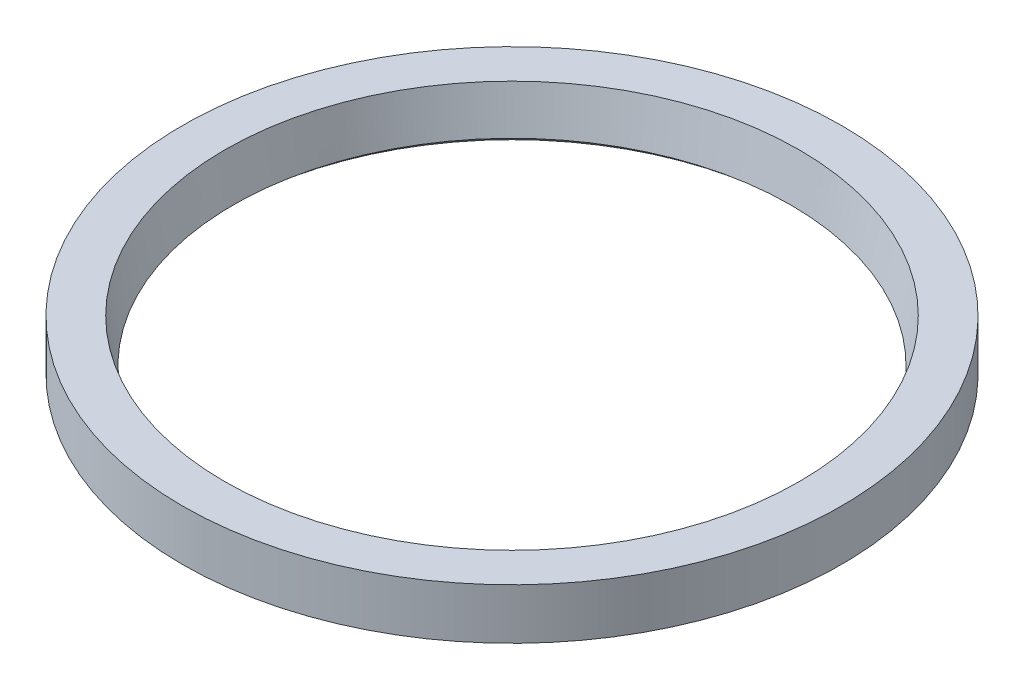
ISO-10303-21;
HEADER;
FILE_DESCRIPTION(('STEP AP214'),'2;1');
FILE_NAME('part.step','',(''),(''),'','','');
FILE_SCHEMA(('AUTOMOTIVE_DESIGN { 1 0 10303 214 1 1 1 1 }'));
ENDSEC;
DATA;
#1=APPLICATION_CONTEXT('core data for automotive mechanical design processes');
#2=APPLICATION_PROTOCOL_DEFINITION('international standard','automotive_design',2000,#1);
#3=PRODUCT_CONTEXT('',#1,'mechanical');
#4=PRODUCT('Part','Part','',(#3));
#5=PRODUCT_RELATED_PRODUCT_CATEGORY('part','',(#4));
#6=PRODUCT_DEFINITION_FORMATION('','',#4);
#7=PRODUCT_DEFINITION_CONTEXT('part definition',#1,'design');
#8=PRODUCT_DEFINITION('design','',#6,#7);
#9=PRODUCT_DEFINITION_SHAPE('','',#8);
#10=(LENGTH_UNIT() NAMED_UNIT(*) SI_UNIT(.MILLI.,.METRE.));
#11=(NAMED_UNIT(*) PLANE_ANGLE_UNIT() SI_UNIT($,.RADIAN.));
#12=(NAMED_UNIT(*) SI_UNIT($,.STERADIAN.) SOLID_ANGLE_UNIT());
#13=UNCERTAINTY_MEASURE_WITH_UNIT(LENGTH_MEASURE(1.E-05),#10,'distance_accuracy_value','');
#14=(GEOMETRIC_REPRESENTATION_CONTEXT(3) GLOBAL_UNCERTAINTY_ASSIGNED_CONTEXT((#13)) GLOBAL_UNIT_ASSIGNED_CONTEXT((#10,
#11,#12)) REPRESENTATION_CONTEXT('',''));
#15=CARTESIAN_POINT('',(0.,0.,0.));
#16=DIRECTION('',(0.,0.,1.));
#17=DIRECTION('',(1.,0.,0.));
#18=AXIS2_PLACEMENT_3D('',#15,#16,#17);
#19=CARTESIAN_POINT('',(0.,0.434794772802015,0.));
#20=DIRECTION('',(0.,-1.,0.));
#21=DIRECTION('',(0.,0.,-1.));
#22=AXIS2_PLACEMENT_3D('',#19,#20,#21);
#23=CONICAL_SURFACE('',#22,16.4887012150477,0.866085653235625);
#24=CARTESIAN_POINT('',(0.,0.,0.));
#25=DIRECTION('',(0.,-1.,0.));
#26=DIRECTION('',(0.,0.,-1.));
#27=AXIS2_PLACEMENT_3D('',#24,#25,#26);
#28=CIRCLE('',#27,17.);
#29=CARTESIAN_POINT('',(0.,0.,-17.));
#30=VERTEX_POINT('',#29);
#31=EDGE_CURVE('E54',#30,#30,#28,.T.);
#32=ORIENTED_EDGE('',*,*,#31,.T.);
#33=EDGE_LOOP('',(#32));
#34=FACE_BOUND('',#33,.T.);
#35=CARTESIAN_POINT('',(0.,0.434794772802015,0.));
#36=DIRECTION('',(0.,-1.,0.));
#37=DIRECTION('',(0.,0.,-1.));
#38=AXIS2_PLACEMENT_3D('',#35,#36,#37);
#39=CIRCLE('',#38,16.4887012150477);
#40=CARTESIAN_POINT('',(0.,0.434794772802015,-16.4887012150477));
#41=VERTEX_POINT('',#40);
#42=EDGE_CURVE('E10',#41,#41,#39,.T.);
#43=ORIENTED_EDGE('',*,*,#42,.F.);
#44=EDGE_LOOP('',(#43));
#45=FACE_BOUND('',#44,.T.);
#46=ADVANCED_FACE('F35',(#34,#45),#23,.F.);
#47=CARTESIAN_POINT('',(0.,3.,0.));
#48=DIRECTION('',(0.,1.,0.));
#49=DIRECTION('',(0.,0.,1.));
#50=AXIS2_PLACEMENT_3D('',#47,#48,#49);
#51=CONICAL_SURFACE('',#50,17.,0.196742407793568);
#52=ORIENTED_EDGE('',*,*,#42,.T.);
#53=EDGE_LOOP('',(#52));
#54=FACE_BOUND('',#53,.T.);
#55=CARTESIAN_POINT('',(0.,3.,0.));
#56=DIRECTION('',(0.,-1.,0.));
#57=DIRECTION('',(0.,0.,-1.));
#58=AXIS2_PLACEMENT_3D('',#55,#56,#57);
#59=CIRCLE('',#58,17.);
#60=CARTESIAN_POINT('',(0.,3.,-17.));
#61=VERTEX_POINT('',#60);
#62=EDGE_CURVE('E41',#61,#61,#59,.T.);
#63=ORIENTED_EDGE('',*,*,#62,.F.);
#64=EDGE_LOOP('',(#63));
#65=FACE_BOUND('',#64,.T.);
#66=ADVANCED_FACE('F72',(#54,#65),#51,.F.);
#67=CARTESIAN_POINT('',(19.5,3.,0.));
#68=DIRECTION('',(0.,1.,0.));
#69=DIRECTION('',(0.,0.,1.));
#70=AXIS2_PLACEMENT_3D('',#67,#68,#69);
#71=PLANE('',#70);
#72=ORIENTED_EDGE('',*,*,#62,.T.);
#73=EDGE_LOOP('',(#72));
#74=FACE_BOUND('',#73,.T.);
#75=CARTESIAN_POINT('',(0.,3.,0.));
#76=DIRECTION('',(0.,-1.,0.));
#77=DIRECTION('',(0.,0.,-1.));
#78=AXIS2_PLACEMENT_3D('',#75,#76,#77);
#79=CIRCLE('',#78,19.5);
#80=CARTESIAN_POINT('',(0.,3.,-19.5));
#81=VERTEX_POINT('',#80);
#82=EDGE_CURVE('E45',#81,#81,#79,.T.);
#83=ORIENTED_EDGE('',*,*,#82,.F.);
#84=EDGE_LOOP('',(#83));
#85=FACE_BOUND('',#84,.T.);
#86=ADVANCED_FACE('F68',(#74,#85),#71,.T.);
#87=CARTESIAN_POINT('',(0.,0.,0.));
#88=DIRECTION('',(0.,-1.,0.));
#89=DIRECTION('',(0.,0.,-1.));
#90=AXIS2_PLACEMENT_3D('',#87,#88,#89);
#91=CYLINDRICAL_SURFACE('',#90,19.5);
#92=ORIENTED_EDGE('',*,*,#82,.T.);
#93=EDGE_LOOP('',(#92));
#94=FACE_BOUND('',#93,.T.);
#95=CARTESIAN_POINT('',(0.,0.,0.));
#96=DIRECTION('',(0.,-1.,0.));
#97=DIRECTION('',(0.,0.,-1.));
#98=AXIS2_PLACEMENT_3D('',#95,#96,#97);
#99=CIRCLE('',#98,19.5);
#100=CARTESIAN_POINT('',(0.,0.,-19.5));
#101=VERTEX_POINT('',#100);
#102=EDGE_CURVE('E49',#101,#101,#99,.T.);
#103=ORIENTED_EDGE('',*,*,#102,.F.);
#104=EDGE_LOOP('',(#103));
#105=FACE_BOUND('',#104,.T.);
#106=ADVANCED_FACE('F62',(#94,#105),#91,.T.);
#107=CARTESIAN_POINT('',(17.,0.,0.));
#108=DIRECTION('',(0.,-1.,0.));
#109=DIRECTION('',(0.,0.,-1.));
#110=AXIS2_PLACEMENT_3D('',#107,#108,#109);
#111=PLANE('',#110);
#112=ORIENTED_EDGE('',*,*,#102,.T.);
#113=EDGE_LOOP('',(#112));
#114=FACE_BOUND('',#113,.T.);
#115=ORIENTED_EDGE('',*,*,#31,.F.);
#116=EDGE_LOOP('',(#115));
#117=FACE_BOUND('',#116,.T.);
#118=ADVANCED_FACE('F60',(#114,#117),#111,.T.);
#119=CLOSED_SHELL('',(#46,#66,#86,#106,#118));
#120=MANIFOLD_SOLID_BREP('B2',#119);
#121=ADVANCED_BREP_SHAPE_REPRESENTATION('',(#18,#120),#14);
#122=SHAPE_DEFINITION_REPRESENTATION(#9,#121);
ENDSEC;
END-ISO-10303-21;
